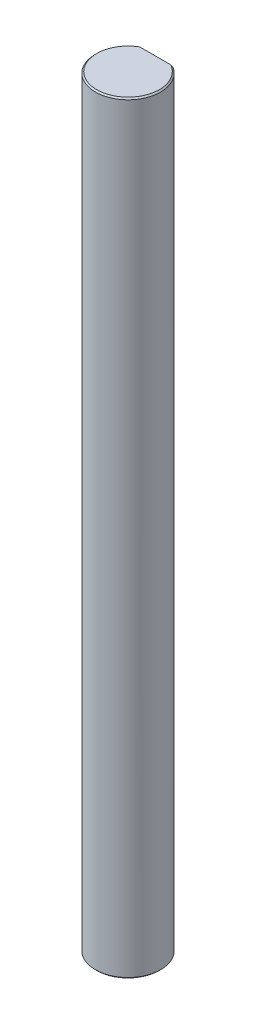
ISO-10303-21;
HEADER;
FILE_DESCRIPTION(('STEP AP214'),'2;1');
FILE_NAME('part.step','',(''),(''),'','','');
FILE_SCHEMA(('AUTOMOTIVE_DESIGN { 1 0 10303 214 1 1 1 1 }'));
ENDSEC;
DATA;
#1=APPLICATION_CONTEXT('core data for automotive mechanical design processes');
#2=APPLICATION_PROTOCOL_DEFINITION('international standard','automotive_design',2000,#1);
#3=PRODUCT_CONTEXT('',#1,'mechanical');
#4=PRODUCT('Part','Part','',(#3));
#5=PRODUCT_RELATED_PRODUCT_CATEGORY('part','',(#4));
#6=PRODUCT_DEFINITION_FORMATION('','',#4);
#7=PRODUCT_DEFINITION_CONTEXT('part definition',#1,'design');
#8=PRODUCT_DEFINITION('design','',#6,#7);
#9=PRODUCT_DEFINITION_SHAPE('','',#8);
#10=(LENGTH_UNIT() NAMED_UNIT(*) SI_UNIT(.MILLI.,.METRE.));
#11=(NAMED_UNIT(*) PLANE_ANGLE_UNIT() SI_UNIT($,.RADIAN.));
#12=(NAMED_UNIT(*) SI_UNIT($,.STERADIAN.) SOLID_ANGLE_UNIT());
#13=UNCERTAINTY_MEASURE_WITH_UNIT(LENGTH_MEASURE(1.E-05),#10,'distance_accuracy_value','');
#14=(GEOMETRIC_REPRESENTATION_CONTEXT(3) GLOBAL_UNCERTAINTY_ASSIGNED_CONTEXT((#13)) GLOBAL_UNIT_ASSIGNED_CONTEXT((#10,
#11,#12)) REPRESENTATION_CONTEXT('',''));
#15=CARTESIAN_POINT('',(0.,0.,0.));
#16=DIRECTION('',(0.,0.,1.));
#17=DIRECTION('',(1.,0.,0.));
#18=AXIS2_PLACEMENT_3D('',#15,#16,#17);
#19=CARTESIAN_POINT('',(0.,70.,0.));
#20=DIRECTION('',(0.,-1.,0.));
#21=DIRECTION('',(0.,0.,-1.));
#22=AXIS2_PLACEMENT_3D('',#19,#20,#21);
#23=CONICAL_SURFACE('',#22,2.875,0.785398163397467);
#24=CARTESIAN_POINT('',(-1.6583123951777,69.875,-2.5));
#25=CARTESIAN_POINT('',(-1.57973572193475,69.9184348904035,-2.5));
#26=CARTESIAN_POINT('',(-1.50022900034239,69.9602466964647,-2.5));
#27=CARTESIAN_POINT('',(-1.41972708645006,70.,-2.5));
#28=(BOUNDED_CURVE() B_SPLINE_CURVE(3,(#24,#25,#26,#27),.UNSPECIFIED.,.F.,
.F.) B_SPLINE_CURVE_WITH_KNOTS((4,4),(0.,0.000269347265701108),
.UNSPECIFIED.) CURVE() GEOMETRIC_REPRESENTATION_ITEM() RATIONAL_B_SPLINE_CURVE((1.,1.,1.,1.)) REPRESENTATION_ITEM(''));
#29=CARTESIAN_POINT('',(-1.6583123951777,69.875,-2.5));
#30=VERTEX_POINT('',#29);
#31=CARTESIAN_POINT('',(-1.41972708645006,70.,-2.5));
#32=VERTEX_POINT('',#31);
#33=EDGE_CURVE('E89',#30,#32,#28,.T.);
#34=ORIENTED_EDGE('',*,*,#33,.F.);
#35=CARTESIAN_POINT('',(0.,69.875,0.));
#36=DIRECTION('',(0.,-1.,0.));
#37=DIRECTION('',(0.,0.,1.));
#38=AXIS2_PLACEMENT_3D('',#35,#36,#37);
#39=CIRCLE('',#38,3.);
#40=CARTESIAN_POINT('',(1.6583123951777,69.875,-2.5));
#41=VERTEX_POINT('',#40);
#42=EDGE_CURVE('E96',#41,#30,#39,.T.);
#43=ORIENTED_EDGE('',*,*,#42,.F.);
#44=CARTESIAN_POINT('',(1.41972708645006,70.,-2.5));
#45=CARTESIAN_POINT('',(1.50022900034238,69.9602466964647,-2.5));
#46=CARTESIAN_POINT('',(1.57973572193476,69.9184348904036,-2.5));
#47=CARTESIAN_POINT('',(1.6583123951777,69.875,-2.5));
#48=(BOUNDED_CURVE() B_SPLINE_CURVE(3,(#44,#45,#46,#47),.UNSPECIFIED.,.F.,
.F.) B_SPLINE_CURVE_WITH_KNOTS((4,4),(0.,0.000269347265701108),
.UNSPECIFIED.) CURVE() GEOMETRIC_REPRESENTATION_ITEM() RATIONAL_B_SPLINE_CURVE((1.,1.,1.,1.)) REPRESENTATION_ITEM(''));
#49=CARTESIAN_POINT('',(1.41972708645006,70.,-2.5));
#50=VERTEX_POINT('',#49);
#51=EDGE_CURVE('E116',#50,#41,#48,.T.);
#52=ORIENTED_EDGE('',*,*,#51,.F.);
#53=CARTESIAN_POINT('',(0.,70.,0.));
#54=DIRECTION('',(0.,1.,0.));
#55=DIRECTION('',(0.,0.,1.));
#56=AXIS2_PLACEMENT_3D('',#53,#54,#55);
#57=CIRCLE('',#56,2.875);
#58=EDGE_CURVE('E25',#32,#50,#57,.T.);
#59=ORIENTED_EDGE('',*,*,#58,.F.);
#60=EDGE_LOOP('',(#34,#43,#52,#59));
#61=FACE_BOUND('',#60,.T.);
#62=ADVANCED_FACE('F16',(#61),#23,.T.);
#63=CARTESIAN_POINT('',(0.,0.125,0.));
#64=DIRECTION('',(0.,1.,0.));
#65=DIRECTION('',(0.,0.,1.));
#66=AXIS2_PLACEMENT_3D('',#63,#64,#65);
#67=CONICAL_SURFACE('',#66,3.,0.785398163397438);
#68=DIRECTION('',(0.,0.707106781186555,0.70710678118654));
#69=VECTOR('',#68,1.);
#70=CARTESIAN_POINT('',(0.,0.125,3.));
#71=LINE('',#70,#69);
#72=CARTESIAN_POINT('',(0.,0.,2.875));
#73=VERTEX_POINT('',#72);
#74=CARTESIAN_POINT('',(0.,0.125,3.));
#75=VERTEX_POINT('',#74);
#76=EDGE_CURVE('E78',#73,#75,#71,.T.);
#77=ORIENTED_EDGE('',*,*,#76,.F.);
#78=CARTESIAN_POINT('',(0.,0.,0.));
#79=DIRECTION('',(0.,-1.,0.));
#80=DIRECTION('',(0.,0.,1.));
#81=AXIS2_PLACEMENT_3D('',#78,#79,#80);
#82=CIRCLE('',#81,2.875);
#83=CARTESIAN_POINT('',(1.41972708645007,0.,-2.5));
#84=VERTEX_POINT('',#83);
#85=EDGE_CURVE('E10',#84,#73,#82,.T.);
#86=ORIENTED_EDGE('',*,*,#85,.F.);
#87=CARTESIAN_POINT('',(1.6583123951777,0.125,-2.5));
#88=CARTESIAN_POINT('',(1.57973572193476,0.0815651095964662,-2.5));
#89=CARTESIAN_POINT('',(1.5002290003424,0.0397533035352772,-2.5));
#90=CARTESIAN_POINT('',(1.41972708645007,0.,-2.5));
#91=(BOUNDED_CURVE() B_SPLINE_CURVE(3,(#87,#88,#89,#90),.UNSPECIFIED.,.F.,
.F.) B_SPLINE_CURVE_WITH_KNOTS((4,4),(0.,0.000269347265701095),
.UNSPECIFIED.) CURVE() GEOMETRIC_REPRESENTATION_ITEM() RATIONAL_B_SPLINE_CURVE((1.,1.,1.,1.)) REPRESENTATION_ITEM(''));
#92=CARTESIAN_POINT('',(1.6583123951777,0.125,-2.5));
#93=VERTEX_POINT('',#92);
#94=EDGE_CURVE('E75',#93,#84,#91,.T.);
#95=ORIENTED_EDGE('',*,*,#94,.F.);
#96=CARTESIAN_POINT('',(0.,0.125,0.));
#97=DIRECTION('',(0.,1.,0.));
#98=DIRECTION('',(0.,0.,1.));
#99=AXIS2_PLACEMENT_3D('',#96,#97,#98);
#100=CIRCLE('',#99,3.);
#101=EDGE_CURVE('E312',#75,#93,#100,.T.);
#102=ORIENTED_EDGE('',*,*,#101,.F.);
#103=EDGE_LOOP('',(#77,#86,#95,#102));
#104=FACE_BOUND('',#103,.T.);
#105=ADVANCED_FACE('F73',(#104),#67,.T.);
#106=CARTESIAN_POINT('',(0.,0.,0.));
#107=DIRECTION('',(0.,1.,0.));
#108=DIRECTION('',(1.,0.,0.));
#109=AXIS2_PLACEMENT_3D('',#106,#107,#108);
#110=PLANE('',#109);
#111=DIRECTION('',(1.,0.,0.));
#112=VECTOR('',#111,1.);
#113=CARTESIAN_POINT('',(0.,0.,-2.5));
#114=LINE('',#113,#112);
#115=CARTESIAN_POINT('',(-1.41972708645007,0.,-2.5));
#116=VERTEX_POINT('',#115);
#117=EDGE_CURVE('E82',#116,#84,#114,.T.);
#118=ORIENTED_EDGE('',*,*,#117,.T.);
#119=ORIENTED_EDGE('',*,*,#85,.T.);
#120=CARTESIAN_POINT('',(0.,0.,0.));
#121=DIRECTION('',(0.,-1.,0.));
#122=DIRECTION('',(0.,0.,1.));
#123=AXIS2_PLACEMENT_3D('',#120,#121,#122);
#124=CIRCLE('',#123,2.875);
#125=EDGE_CURVE('E84',#73,#116,#124,.T.);
#126=ORIENTED_EDGE('',*,*,#125,.T.);
#127=EDGE_LOOP('',(#118,#119,#126));
#128=FACE_BOUND('',#127,.T.);
#129=ADVANCED_FACE('F83',(#128),#110,.F.);
#130=CARTESIAN_POINT('',(0.,70.,0.));
#131=DIRECTION('',(0.,1.,0.));
#132=DIRECTION('',(1.,0.,0.));
#133=AXIS2_PLACEMENT_3D('',#130,#131,#132);
#134=PLANE('',#133);
#135=DIRECTION('',(1.,0.,0.));
#136=VECTOR('',#135,1.);
#137=CARTESIAN_POINT('',(0.,70.,-2.5));
#138=LINE('',#137,#136);
#139=EDGE_CURVE('E115',#32,#50,#138,.T.);
#140=ORIENTED_EDGE('',*,*,#139,.F.);
#141=ORIENTED_EDGE('',*,*,#58,.T.);
#142=EDGE_LOOP('',(#140,#141));
#143=FACE_BOUND('',#142,.T.);
#144=ADVANCED_FACE('F167',(#143),#134,.T.);
#145=CARTESIAN_POINT('',(0.,70.,-2.5));
#146=DIRECTION('',(0.,0.,-1.));
#147=DIRECTION('',(0.,-1.,0.));
#148=AXIS2_PLACEMENT_3D('',#145,#146,#147);
#149=PLANE('',#148);
#150=DIRECTION('',(0.,-1.,0.));
#151=VECTOR('',#150,1.);
#152=CARTESIAN_POINT('',(1.6583123951777,70.,-2.5));
#153=LINE('',#152,#151);
#154=EDGE_CURVE('E93',#41,#93,#153,.T.);
#155=ORIENTED_EDGE('',*,*,#154,.T.);
#156=ORIENTED_EDGE('',*,*,#94,.T.);
#157=ORIENTED_EDGE('',*,*,#117,.F.);
#158=CARTESIAN_POINT('',(-1.41972708645007,0.,-2.5));
#159=CARTESIAN_POINT('',(-1.50022900034239,0.039753303535301,-2.5));
#160=CARTESIAN_POINT('',(-1.57973572193477,0.0815651095964539,-2.5));
#161=CARTESIAN_POINT('',(-1.6583123951777,0.125,-2.5));
#162=(BOUNDED_CURVE() B_SPLINE_CURVE(3,(#158,#159,#160,#161),.UNSPECIFIED.,.F.,
.F.) B_SPLINE_CURVE_WITH_KNOTS((4,4),(0.,0.000269347265701095),
.UNSPECIFIED.) CURVE() GEOMETRIC_REPRESENTATION_ITEM() RATIONAL_B_SPLINE_CURVE((1.,1.,1.,1.)) REPRESENTATION_ITEM(''));
#163=CARTESIAN_POINT('',(-1.6583123951777,0.125,-2.5));
#164=VERTEX_POINT('',#163);
#165=EDGE_CURVE('E309',#116,#164,#162,.T.);
#166=ORIENTED_EDGE('',*,*,#165,.T.);
#167=DIRECTION('',(0.,-1.,0.));
#168=VECTOR('',#167,1.);
#169=CARTESIAN_POINT('',(-1.6583123951777,70.,-2.5));
#170=LINE('',#169,#168);
#171=EDGE_CURVE('E308',#30,#164,#170,.T.);
#172=ORIENTED_EDGE('',*,*,#171,.F.);
#173=ORIENTED_EDGE('',*,*,#33,.T.);
#174=ORIENTED_EDGE('',*,*,#139,.T.);
#175=ORIENTED_EDGE('',*,*,#51,.T.);
#176=EDGE_LOOP('',(#155,#156,#157,#166,#172,#173,#174,#175));
#177=FACE_BOUND('',#176,.T.);
#178=ADVANCED_FACE('F91',(#177),#149,.T.);
#179=CARTESIAN_POINT('',(0.,70.,0.));
#180=DIRECTION('',(0.,-1.,0.));
#181=DIRECTION('',(0.,0.,-1.));
#182=AXIS2_PLACEMENT_3D('',#179,#180,#181);
#183=CYLINDRICAL_SURFACE('',#182,3.);
#184=ORIENTED_EDGE('',*,*,#171,.T.);
#185=CARTESIAN_POINT('',(0.,0.125,0.));
#186=DIRECTION('',(0.,1.,0.));
#187=DIRECTION('',(0.,0.,1.));
#188=AXIS2_PLACEMENT_3D('',#185,#186,#187);
#189=CIRCLE('',#188,3.);
#190=EDGE_CURVE('E320',#164,#75,#189,.T.);
#191=ORIENTED_EDGE('',*,*,#190,.T.);
#192=ORIENTED_EDGE('',*,*,#101,.T.);
#193=ORIENTED_EDGE('',*,*,#154,.F.);
#194=ORIENTED_EDGE('',*,*,#42,.T.);
#195=EDGE_LOOP('',(#184,#191,#192,#193,#194));
#196=FACE_BOUND('',#195,.T.);
#197=ADVANCED_FACE('F145',(#196),#183,.T.);
#198=CARTESIAN_POINT('',(0.,0.125,0.));
#199=DIRECTION('',(0.,1.,0.));
#200=DIRECTION('',(0.,0.,1.));
#201=AXIS2_PLACEMENT_3D('',#198,#199,#200);
#202=CONICAL_SURFACE('',#201,3.,0.785398163397438);
#203=ORIENTED_EDGE('',*,*,#125,.F.);
#204=ORIENTED_EDGE('',*,*,#76,.T.);
#205=ORIENTED_EDGE('',*,*,#190,.F.);
#206=ORIENTED_EDGE('',*,*,#165,.F.);
#207=EDGE_LOOP('',(#203,#204,#205,#206));
#208=FACE_BOUND('',#207,.T.);
#209=ADVANCED_FACE('F140',(#208),#202,.T.);
#210=CLOSED_SHELL('',(#62,#105,#129,#144,#178,#197,#209));
#211=MANIFOLD_SOLID_BREP('B1',#210);
#212=ADVANCED_BREP_SHAPE_REPRESENTATION('',(#18,#211),#14);
#213=SHAPE_DEFINITION_REPRESENTATION(#9,#212);
ENDSEC;
END-ISO-10303-21;
